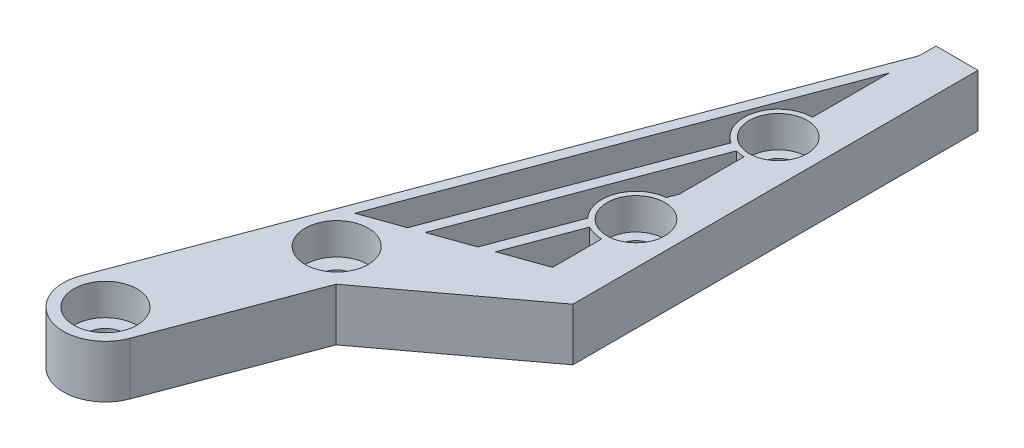
ISO-10303-21;
HEADER;
FILE_DESCRIPTION(('STEP AP214'),'2;1');
FILE_NAME('part.step','',(''),(''),'','','');
FILE_SCHEMA(('AUTOMOTIVE_DESIGN { 1 0 10303 214 1 1 1 1 }'));
ENDSEC;
DATA;
#1=APPLICATION_CONTEXT('core data for automotive mechanical design processes');
#2=APPLICATION_PROTOCOL_DEFINITION('international standard','automotive_design',2000,#1);
#3=PRODUCT_CONTEXT('',#1,'mechanical');
#4=PRODUCT('Part','Part','',(#3));
#5=PRODUCT_RELATED_PRODUCT_CATEGORY('part','',(#4));
#6=PRODUCT_DEFINITION_FORMATION('','',#4);
#7=PRODUCT_DEFINITION_CONTEXT('part definition',#1,'design');
#8=PRODUCT_DEFINITION('design','',#6,#7);
#9=PRODUCT_DEFINITION_SHAPE('','',#8);
#10=(LENGTH_UNIT() NAMED_UNIT(*) SI_UNIT(.MILLI.,.METRE.));
#11=(NAMED_UNIT(*) PLANE_ANGLE_UNIT() SI_UNIT($,.RADIAN.));
#12=(NAMED_UNIT(*) SI_UNIT($,.STERADIAN.) SOLID_ANGLE_UNIT());
#13=UNCERTAINTY_MEASURE_WITH_UNIT(LENGTH_MEASURE(1.E-05),#10,'distance_accuracy_value','');
#14=(GEOMETRIC_REPRESENTATION_CONTEXT(3) GLOBAL_UNCERTAINTY_ASSIGNED_CONTEXT((#13)) GLOBAL_UNIT_ASSIGNED_CONTEXT((#10,
#11,#12)) REPRESENTATION_CONTEXT('',''));
#15=CARTESIAN_POINT('',(0.,0.,0.));
#16=DIRECTION('',(0.,0.,1.));
#17=DIRECTION('',(1.,0.,0.));
#18=AXIS2_PLACEMENT_3D('',#15,#16,#17);
#19=CARTESIAN_POINT('',(0.,5.,0.));
#20=DIRECTION('',(0.,-1.,0.));
#21=DIRECTION('',(0.,0.,1.));
#22=AXIS2_PLACEMENT_3D('',#19,#20,#21);
#23=CYLINDRICAL_SURFACE('',#22,1.75);
#24=CARTESIAN_POINT('',(0.,0.,0.));
#25=DIRECTION('',(0.,-1.,0.));
#26=DIRECTION('',(0.,0.,-1.));
#27=AXIS2_PLACEMENT_3D('',#24,#25,#26);
#28=CIRCLE('',#27,1.75);
#29=CARTESIAN_POINT('',(0.,0.,-1.75));
#30=VERTEX_POINT('',#29);
#31=EDGE_CURVE('E335',#30,#30,#28,.T.);
#32=ORIENTED_EDGE('',*,*,#31,.T.);
#33=EDGE_LOOP('',(#32));
#34=FACE_BOUND('',#33,.T.);
#35=CARTESIAN_POINT('',(0.,2.,0.));
#36=DIRECTION('',(0.,-1.,0.));
#37=DIRECTION('',(0.,0.,-1.));
#38=AXIS2_PLACEMENT_3D('',#35,#36,#37);
#39=CIRCLE('',#38,1.75);
#40=CARTESIAN_POINT('',(0.,2.,-1.75));
#41=VERTEX_POINT('',#40);
#42=EDGE_CURVE('E43',#41,#41,#39,.T.);
#43=ORIENTED_EDGE('',*,*,#42,.F.);
#44=EDGE_LOOP('',(#43));
#45=FACE_BOUND('',#44,.T.);
#46=ADVANCED_FACE('F39',(#34,#45),#23,.F.);
#47=CARTESIAN_POINT('',(6.,5.,-16.));
#48=DIRECTION('',(0.,-1.,0.));
#49=DIRECTION('',(0.,0.,1.));
#50=AXIS2_PLACEMENT_3D('',#47,#48,#49);
#51=CYLINDRICAL_SURFACE('',#50,1.5);
#52=CARTESIAN_POINT('',(6.,0.,-16.));
#53=DIRECTION('',(0.,-1.,0.));
#54=DIRECTION('',(0.,0.,-1.));
#55=AXIS2_PLACEMENT_3D('',#52,#53,#54);
#56=CIRCLE('',#55,1.5);
#57=CARTESIAN_POINT('',(6.,0.,-17.5));
#58=VERTEX_POINT('',#57);
#59=EDGE_CURVE('E323',#58,#58,#56,.T.);
#60=ORIENTED_EDGE('',*,*,#59,.T.);
#61=EDGE_LOOP('',(#60));
#62=FACE_BOUND('',#61,.T.);
#63=CARTESIAN_POINT('',(6.,2.,-16.));
#64=DIRECTION('',(0.,-1.,0.));
#65=DIRECTION('',(0.,0.,-1.));
#66=AXIS2_PLACEMENT_3D('',#63,#64,#65);
#67=CIRCLE('',#66,1.5);
#68=CARTESIAN_POINT('',(6.,2.,-17.5));
#69=VERTEX_POINT('',#68);
#70=EDGE_CURVE('E397',#69,#69,#67,.T.);
#71=ORIENTED_EDGE('',*,*,#70,.F.);
#72=EDGE_LOOP('',(#71));
#73=FACE_BOUND('',#72,.T.);
#74=ADVANCED_FACE('F408',(#62,#73),#51,.F.);
#75=CARTESIAN_POINT('',(18.,-4.94974746830584,-46.));
#76=DIRECTION('',(0.,1.,0.));
#77=DIRECTION('',(0.,0.,-1.));
#78=AXIS2_PLACEMENT_3D('',#75,#76,#77);
#79=CYLINDRICAL_SURFACE('',#78,1.75);
#80=CARTESIAN_POINT('',(18.,0.,-46.));
#81=DIRECTION('',(0.,-1.,0.));
#82=DIRECTION('',(0.,0.,-1.));
#83=AXIS2_PLACEMENT_3D('',#80,#81,#82);
#84=CIRCLE('',#83,1.75);
#85=CARTESIAN_POINT('',(18.,0.,-47.75));
#86=VERTEX_POINT('',#85);
#87=EDGE_CURVE('E257',#86,#86,#84,.F.);
#88=ORIENTED_EDGE('',*,*,#87,.F.);
#89=EDGE_LOOP('',(#88));
#90=FACE_BOUND('',#89,.T.);
#91=CARTESIAN_POINT('',(18.,2.,-46.));
#92=DIRECTION('',(0.,-1.,0.));
#93=DIRECTION('',(0.,0.,-1.));
#94=AXIS2_PLACEMENT_3D('',#91,#92,#93);
#95=CIRCLE('',#94,1.75);
#96=CARTESIAN_POINT('',(18.,2.,-47.75));
#97=VERTEX_POINT('',#96);
#98=EDGE_CURVE('E395',#97,#97,#95,.F.);
#99=ORIENTED_EDGE('',*,*,#98,.T.);
#100=EDGE_LOOP('',(#99));
#101=FACE_BOUND('',#100,.T.);
#102=ADVANCED_FACE('F414',(#90,#101),#79,.F.);
#103=CARTESIAN_POINT('',(18.,-4.94974746830584,-32.4668375007661));
#104=DIRECTION('',(0.,1.,0.));
#105=DIRECTION('',(0.,0.,-1.));
#106=AXIS2_PLACEMENT_3D('',#103,#104,#105);
#107=CYLINDRICAL_SURFACE('',#106,1.75);
#108=CARTESIAN_POINT('',(18.,0.,-32.4668375007661));
#109=DIRECTION('',(0.,-1.,0.));
#110=DIRECTION('',(0.,0.,-1.));
#111=AXIS2_PLACEMENT_3D('',#108,#109,#110);
#112=CIRCLE('',#111,1.75);
#113=CARTESIAN_POINT('',(18.,0.,-34.2168375007661));
#114=VERTEX_POINT('',#113);
#115=EDGE_CURVE('E253',#114,#114,#112,.F.);
#116=ORIENTED_EDGE('',*,*,#115,.F.);
#117=EDGE_LOOP('',(#116));
#118=FACE_BOUND('',#117,.T.);
#119=CARTESIAN_POINT('',(18.,2.,-32.4668375007661));
#120=DIRECTION('',(0.,-1.,0.));
#121=DIRECTION('',(0.,0.,-1.));
#122=AXIS2_PLACEMENT_3D('',#119,#120,#121);
#123=CIRCLE('',#122,1.75);
#124=CARTESIAN_POINT('',(18.,2.,-34.2168375007661));
#125=VERTEX_POINT('',#124);
#126=EDGE_CURVE('E232',#125,#125,#123,.F.);
#127=ORIENTED_EDGE('',*,*,#126,.T.);
#128=EDGE_LOOP('',(#127));
#129=FACE_BOUND('',#128,.T.);
#130=ADVANCED_FACE('F792',(#118,#129),#107,.F.);
#131=CARTESIAN_POINT('',(12.7717220072743,-42.9863621817415,-22.6659203589747));
#132=DIRECTION('',(-0.936329177569045,0.,-0.351123441588392));
#133=DIRECTION('',(0.351123441588392,0.,-0.936329177569045));
#134=AXIS2_PLACEMENT_3D('',#131,#132,#133);
#135=PLANE('',#134);
#136=DIRECTION('',(0.,1.,0.));
#137=VECTOR('',#136,1.);
#138=CARTESIAN_POINT('',(17.6590925102293,-9.19238815542513,-35.6989083668547));
#139=LINE('',#138,#137);
#140=CARTESIAN_POINT('',(17.6590925102293,0.,-35.6989083668547));
#141=VERTEX_POINT('',#140);
#142=CARTESIAN_POINT('',(17.6590925102293,5.,-35.6989083668547));
#143=VERTEX_POINT('',#142);
#144=EDGE_CURVE('E48',#141,#143,#139,.T.);
#145=ORIENTED_EDGE('',*,*,#144,.T.);
#146=DIRECTION('',(0.351123441588392,0.,-0.936329177569045));
#147=VECTOR('',#146,1.);
#148=CARTESIAN_POINT('',(12.7717220072743,5.,-22.6659203589747));
#149=LINE('',#148,#147);
#150=CARTESIAN_POINT('',(18.,5.,-36.6079950062433));
#151=VERTEX_POINT('',#150);
#152=EDGE_CURVE('E285',#143,#151,#149,.T.);
#153=ORIENTED_EDGE('',*,*,#152,.T.);
#154=DIRECTION('',(0.,1.,0.));
#155=VECTOR('',#154,1.);
#156=CARTESIAN_POINT('',(18.,-42.9863621817415,-36.6079950062433));
#157=LINE('',#156,#155);
#158=CARTESIAN_POINT('',(18.,0.,-36.6079950062433));
#159=VERTEX_POINT('',#158);
#160=EDGE_CURVE('E298',#159,#151,#157,.T.);
#161=ORIENTED_EDGE('',*,*,#160,.F.);
#162=DIRECTION('',(-0.351123441588392,0.,0.936329177569045));
#163=VECTOR('',#162,1.);
#164=CARTESIAN_POINT('',(12.7717220072743,0.,-22.6659203589747));
#165=LINE('',#164,#163);
#166=EDGE_CURVE('E303',#159,#141,#165,.T.);
#167=ORIENTED_EDGE('',*,*,#166,.T.);
#168=EDGE_LOOP('',(#145,#153,#161,#167));
#169=FACE_BOUND('',#168,.T.);
#170=ADVANCED_FACE('F529',(#169),#135,.T.);
#171=CARTESIAN_POINT('',(18.,5.,-24.5331624992339));
#172=DIRECTION('',(1.,0.,0.));
#173=DIRECTION('',(0.,0.,1.));
#174=AXIS2_PLACEMENT_3D('',#171,#172,#173);
#175=PLANE('',#174);
#176=DIRECTION('',(0.,0.,-1.));
#177=VECTOR('',#176,1.);
#178=CARTESIAN_POINT('',(18.,0.,-24.5331624992339));
#179=LINE('',#178,#177);
#180=CARTESIAN_POINT('',(18.,0.,-24.5331624992339));
#181=VERTEX_POINT('',#180);
#182=CARTESIAN_POINT('',(18.,0.,-29.2168375007661));
#183=VERTEX_POINT('',#182);
#184=EDGE_CURVE('E369',#181,#183,#179,.T.);
#185=ORIENTED_EDGE('',*,*,#184,.F.);
#186=DIRECTION('',(0.,-1.,0.));
#187=VECTOR('',#186,1.);
#188=CARTESIAN_POINT('',(18.,5.,-24.5331624992339));
#189=LINE('',#188,#187);
#190=CARTESIAN_POINT('',(18.,5.,-24.5331624992339));
#191=VERTEX_POINT('',#190);
#192=EDGE_CURVE('E385',#191,#181,#189,.T.);
#193=ORIENTED_EDGE('',*,*,#192,.F.);
#194=DIRECTION('',(0.,0.,-1.));
#195=VECTOR('',#194,1.);
#196=CARTESIAN_POINT('',(18.,5.,-24.5331624992339));
#197=LINE('',#196,#195);
#198=CARTESIAN_POINT('',(18.,5.,-29.2168375007661));
#199=VERTEX_POINT('',#198);
#200=EDGE_CURVE('E349',#191,#199,#197,.T.);
#201=ORIENTED_EDGE('',*,*,#200,.T.);
#202=DIRECTION('',(0.,1.,0.));
#203=VECTOR('',#202,1.);
#204=CARTESIAN_POINT('',(18.,-9.19238815542513,-29.2168375007661));
#205=LINE('',#204,#203);
#206=EDGE_CURVE('E282',#183,#199,#205,.T.);
#207=ORIENTED_EDGE('',*,*,#206,.F.);
#208=EDGE_LOOP('',(#185,#193,#201,#207));
#209=FACE_BOUND('',#208,.T.);
#210=ADVANCED_FACE('F442',(#209),#175,.F.);
#211=CARTESIAN_POINT('',(2.90648056938186,5.,-19.1426198454417));
#212=DIRECTION('',(0.336336396998156,0.,0.941741911594837));
#213=DIRECTION('',(-0.941741911594837,0.,0.336336396998156));
#214=AXIS2_PLACEMENT_3D('',#211,#212,#213);
#215=PLANE('',#214);
#216=DIRECTION('',(0.941741911594837,0.,-0.336336396998156));
#217=VECTOR('',#216,1.);
#218=CARTESIAN_POINT('',(2.90648056938186,5.,-19.1426198454417));
#219=LINE('',#218,#217);
#220=CARTESIAN_POINT('',(14.0048771870108,5.,-23.1063329231663));
#221=VERTEX_POINT('',#220);
#222=EDGE_CURVE('E343',#221,#191,#219,.T.);
#223=ORIENTED_EDGE('',*,*,#222,.T.);
#224=ORIENTED_EDGE('',*,*,#192,.T.);
#225=DIRECTION('',(0.941741911594837,0.,-0.336336396998156));
#226=VECTOR('',#225,1.);
#227=CARTESIAN_POINT('',(2.90648056938186,0.,-19.1426198454417));
#228=LINE('',#227,#226);
#229=CARTESIAN_POINT('',(14.0048771870108,0.,-23.1063329231663));
#230=VERTEX_POINT('',#229);
#231=EDGE_CURVE('E363',#230,#181,#228,.T.);
#232=ORIENTED_EDGE('',*,*,#231,.F.);
#233=DIRECTION('',(0.,1.,0.));
#234=VECTOR('',#233,1.);
#235=CARTESIAN_POINT('',(14.0048771870108,-42.9863621817415,-23.1063329231663));
#236=LINE('',#235,#234);
#237=EDGE_CURVE('E290',#230,#221,#236,.T.);
#238=ORIENTED_EDGE('',*,*,#237,.T.);
#239=EDGE_LOOP('',(#223,#224,#232,#238));
#240=FACE_BOUND('',#239,.T.);
#241=ADVANCED_FACE('F446',(#240),#215,.F.);
#242=CARTESIAN_POINT('',(18.,0.,-42.75));
#243=VERTEX_POINT('',#242);
#244=EDGE_CURVE('E373',#159,#243,#179,.T.);
#245=ORIENTED_EDGE('',*,*,#244,.F.);
#246=ORIENTED_EDGE('',*,*,#160,.T.);
#247=CARTESIAN_POINT('',(18.,5.,-42.75));
#248=VERTEX_POINT('',#247);
#249=EDGE_CURVE('E353',#151,#248,#197,.T.);
#250=ORIENTED_EDGE('',*,*,#249,.T.);
#251=DIRECTION('',(0.,1.,0.));
#252=VECTOR('',#251,1.);
#253=CARTESIAN_POINT('',(18.,-9.19238815542513,-42.75));
#254=LINE('',#253,#252);
#255=EDGE_CURVE('E270',#243,#248,#254,.T.);
#256=ORIENTED_EDGE('',*,*,#255,.F.);
#257=EDGE_LOOP('',(#245,#246,#250,#256));
#258=FACE_BOUND('',#257,.T.);
#259=ADVANCED_FACE('F467',(#258),#175,.F.);
#260=CARTESIAN_POINT('',(9.07225646806461,0.,-21.3446826663998));
#261=VERTEX_POINT('',#260);
#262=CARTESIAN_POINT('',(12.7717220072743,0.,-22.6659203589747));
#263=VERTEX_POINT('',#262);
#264=EDGE_CURVE('E368',#261,#263,#228,.T.);
#265=ORIENTED_EDGE('',*,*,#264,.F.);
#266=DIRECTION('',(0.,1.,0.));
#267=VECTOR('',#266,1.);
#268=CARTESIAN_POINT('',(9.07225646806461,-42.9863621817415,-21.3446826663998));
#269=LINE('',#268,#267);
#270=CARTESIAN_POINT('',(9.07225646806461,5.,-21.3446826663998));
#271=VERTEX_POINT('',#270);
#272=EDGE_CURVE('E311',#261,#271,#269,.T.);
#273=ORIENTED_EDGE('',*,*,#272,.T.);
#274=CARTESIAN_POINT('',(12.7717220072743,5.,-22.6659203589747));
#275=VERTEX_POINT('',#274);
#276=EDGE_CURVE('E348',#271,#275,#219,.T.);
#277=ORIENTED_EDGE('',*,*,#276,.T.);
#278=DIRECTION('',(0.,1.,0.));
#279=VECTOR('',#278,1.);
#280=CARTESIAN_POINT('',(12.7717220072743,-42.9863621817415,-22.6659203589747));
#281=LINE('',#280,#279);
#282=EDGE_CURVE('E295',#263,#275,#281,.T.);
#283=ORIENTED_EDGE('',*,*,#282,.F.);
#284=EDGE_LOOP('',(#265,#273,#277,#283));
#285=FACE_BOUND('',#284,.T.);
#286=ADVANCED_FACE('F447',(#285),#215,.F.);
#287=CARTESIAN_POINT('',(18.,5.,-49.25));
#288=VERTEX_POINT('',#287);
#289=CARTESIAN_POINT('',(18.,5.,-56.5440037453176));
#290=VERTEX_POINT('',#289);
#291=EDGE_CURVE('E354',#288,#290,#197,.T.);
#292=ORIENTED_EDGE('',*,*,#291,.T.);
#293=DIRECTION('',(0.,1.,0.));
#294=VECTOR('',#293,1.);
#295=CARTESIAN_POINT('',(18.,-42.9863621817415,-56.5440037453176));
#296=LINE('',#295,#294);
#297=CARTESIAN_POINT('',(18.,0.,-56.5440037453176));
#298=VERTEX_POINT('',#297);
#299=EDGE_CURVE('E329',#298,#290,#296,.T.);
#300=ORIENTED_EDGE('',*,*,#299,.F.);
#301=CARTESIAN_POINT('',(18.,0.,-49.25));
#302=VERTEX_POINT('',#301);
#303=EDGE_CURVE('E374',#302,#298,#179,.T.);
#304=ORIENTED_EDGE('',*,*,#303,.F.);
#305=DIRECTION('',(0.,1.,0.));
#306=VECTOR('',#305,1.);
#307=CARTESIAN_POINT('',(18.,-9.19238815542513,-49.25));
#308=LINE('',#307,#306);
#309=EDGE_CURVE('E267',#288,#302,#308,.F.);
#310=ORIENTED_EDGE('',*,*,#309,.F.);
#311=EDGE_LOOP('',(#292,#300,#304,#310));
#312=FACE_BOUND('',#311,.T.);
#313=ADVANCED_FACE('F422',(#312),#175,.F.);
#314=CARTESIAN_POINT('',(0.,5.,0.));
#315=DIRECTION('',(0.,1.,0.));
#316=DIRECTION('',(0.,0.,-1.));
#317=AXIS2_PLACEMENT_3D('',#314,#315,#316);
#318=PLANE('',#317);
#319=DIRECTION('',(0.802095252658659,0.,-0.597196119932508));
#320=VECTOR('',#319,1.);
#321=CARTESIAN_POINT('',(9.09351943061815,5.,-12.8573801545583));
#322=LINE('',#321,#320);
#323=CARTESIAN_POINT('',(9.09351943061815,5.,-12.8573801545583));
#324=VERTEX_POINT('',#323);
#325=CARTESIAN_POINT('',(22.,5.,-22.4668375007661));
#326=VERTEX_POINT('',#325);
#327=EDGE_CURVE('E214',#324,#326,#322,.T.);
#328=ORIENTED_EDGE('',*,*,#327,.T.);
#329=DIRECTION('',(0.,0.,1.));
#330=VECTOR('',#329,1.);
#331=CARTESIAN_POINT('',(22.,5.,-17.4668375007661));
#332=LINE('',#331,#330);
#333=CARTESIAN_POINT('',(22.,5.,-61.));
#334=VERTEX_POINT('',#333);
#335=EDGE_CURVE('E218',#334,#326,#332,.T.);
#336=ORIENTED_EDGE('',*,*,#335,.F.);
#337=DIRECTION('',(1.,0.,0.));
#338=VECTOR('',#337,1.);
#339=CARTESIAN_POINT('',(18.,5.,-61.));
#340=LINE('',#339,#338);
#341=CARTESIAN_POINT('',(18.,5.,-61.));
#342=VERTEX_POINT('',#341);
#343=EDGE_CURVE('E352',#342,#334,#340,.T.);
#344=ORIENTED_EDGE('',*,*,#343,.F.);
#345=CARTESIAN_POINT('',(18.,5.,-59.3920049937567));
#346=VERTEX_POINT('',#345);
#347=EDGE_CURVE('E347',#346,#342,#197,.T.);
#348=ORIENTED_EDGE('',*,*,#347,.F.);
#349=DIRECTION('',(0.351123441588392,0.,-0.936329177569044));
#350=VECTOR('',#349,1.);
#351=CARTESIAN_POINT('',(-3.74531671027618,5.,-1.40449376635357));
#352=LINE('',#351,#350);
#353=CARTESIAN_POINT('',(-3.74531671027618,5.,-1.40449376635357));
#354=VERTEX_POINT('',#353);
#355=EDGE_CURVE('E340',#354,#346,#352,.T.);
#356=ORIENTED_EDGE('',*,*,#355,.F.);
#357=CARTESIAN_POINT('',(0.,5.,0.));
#358=DIRECTION('',(0.,-1.,0.));
#359=DIRECTION('',(0.,0.,-1.));
#360=AXIS2_PLACEMENT_3D('',#357,#358,#359);
#361=CIRCLE('',#360,4.);
#362=CARTESIAN_POINT('',(3.74531671027618,5.,1.40449376635357));
#363=VERTEX_POINT('',#362);
#364=EDGE_CURVE('E217',#363,#354,#361,.T.);
#365=ORIENTED_EDGE('',*,*,#364,.F.);
#366=DIRECTION('',(-0.351123441588392,0.,0.936329177569044));
#367=VECTOR('',#366,1.);
#368=CARTESIAN_POINT('',(3.74531671027618,5.,1.40449376635357));
#369=LINE('',#368,#367);
#370=EDGE_CURVE('E198',#324,#363,#369,.T.);
#371=ORIENTED_EDGE('',*,*,#370,.F.);
#372=EDGE_LOOP('',(#328,#336,#344,#348,#356,#365,#371));
#373=FACE_BOUND('',#372,.T.);
#374=CARTESIAN_POINT('',(0.,5.,0.));
#375=DIRECTION('',(0.,-1.,0.));
#376=DIRECTION('',(0.,0.,-1.));
#377=AXIS2_PLACEMENT_3D('',#374,#375,#376);
#378=CIRCLE('',#377,3.);
#379=CARTESIAN_POINT('',(0.,5.,-3.));
#380=VERTEX_POINT('',#379);
#381=EDGE_CURVE('E233',#380,#380,#378,.T.);
#382=ORIENTED_EDGE('',*,*,#381,.T.);
#383=EDGE_LOOP('',(#382));
#384=FACE_BOUND('',#383,.T.);
#385=CARTESIAN_POINT('',(6.,5.,-16.));
#386=DIRECTION('',(0.,-1.,0.));
#387=DIRECTION('',(0.,0.,-1.));
#388=AXIS2_PLACEMENT_3D('',#385,#386,#387);
#389=CIRCLE('',#388,3.);
#390=CARTESIAN_POINT('',(6.,5.,-19.));
#391=VERTEX_POINT('',#390);
#392=EDGE_CURVE('E239',#391,#391,#389,.T.);
#393=ORIENTED_EDGE('',*,*,#392,.T.);
#394=EDGE_LOOP('',(#393));
#395=FACE_BOUND('',#394,.T.);
#396=CARTESIAN_POINT('',(18.,5.,-32.4668375007661));
#397=DIRECTION('',(0.,-1.,0.));
#398=DIRECTION('',(0.,0.,-1.));
#399=AXIS2_PLACEMENT_3D('',#396,#397,#398);
#400=CIRCLE('',#399,2.75);
#401=CARTESIAN_POINT('',(18.,5.,-35.2168375007661));
#402=VERTEX_POINT('',#401);
#403=EDGE_CURVE('E245',#402,#402,#400,.T.);
#404=ORIENTED_EDGE('',*,*,#403,.T.);
#405=EDGE_LOOP('',(#404));
#406=FACE_BOUND('',#405,.T.);
#407=CARTESIAN_POINT('',(18.,5.,-46.));
#408=DIRECTION('',(0.,-1.,0.));
#409=DIRECTION('',(0.,0.,-1.));
#410=AXIS2_PLACEMENT_3D('',#407,#408,#409);
#411=CIRCLE('',#410,2.75);
#412=CARTESIAN_POINT('',(18.,5.,-48.75));
#413=VERTEX_POINT('',#412);
#414=EDGE_CURVE('E228',#413,#413,#411,.T.);
#415=ORIENTED_EDGE('',*,*,#414,.T.);
#416=EDGE_LOOP('',(#415));
#417=FACE_BOUND('',#416,.T.);
#418=CARTESIAN_POINT('',(18.,5.,-46.));
#419=DIRECTION('',(0.,-1.,0.));
#420=DIRECTION('',(0.,0.,-1.));
#421=AXIS2_PLACEMENT_3D('',#418,#419,#420);
#422=CIRCLE('',#421,3.25);
#423=CARTESIAN_POINT('',(16.2282724901686,5.,-43.2753933071163));
#424=VERTEX_POINT('',#423);
#425=EDGE_CURVE('E256',#424,#288,#422,.T.);
#426=ORIENTED_EDGE('',*,*,#425,.F.);
#427=DIRECTION('',(0.351123441588392,0.,-0.936329177569045));
#428=VECTOR('',#427,1.);
#429=CARTESIAN_POINT('',(7.83910128832806,5.,-20.9042701022082));
#430=LINE('',#429,#428);
#431=CARTESIAN_POINT('',(7.83910128832806,5.,-20.9042701022082));
#432=VERTEX_POINT('',#431);
#433=EDGE_CURVE('E306',#432,#424,#430,.T.);
#434=ORIENTED_EDGE('',*,*,#433,.F.);
#435=CARTESIAN_POINT('',(4.13963574911841,5.,-19.5830324096333));
#436=VERTEX_POINT('',#435);
#437=EDGE_CURVE('E344',#436,#432,#219,.T.);
#438=ORIENTED_EDGE('',*,*,#437,.F.);
#439=DIRECTION('',(-0.351123441588392,0.,0.936329177569045));
#440=VECTOR('',#439,1.);
#441=CARTESIAN_POINT('',(4.13963574911841,5.,-19.5830324096333));
#442=LINE('',#441,#440);
#443=EDGE_CURVE('E320',#290,#436,#442,.T.);
#444=ORIENTED_EDGE('',*,*,#443,.F.);
#445=ORIENTED_EDGE('',*,*,#291,.F.);
#446=EDGE_LOOP('',(#426,#434,#438,#444,#445));
#447=FACE_BOUND('',#446,.T.);
#448=ORIENTED_EDGE('',*,*,#249,.F.);
#449=ORIENTED_EDGE('',*,*,#152,.F.);
#450=CARTESIAN_POINT('',(18.,5.,-32.4668375007661));
#451=DIRECTION('',(0.,-1.,0.));
#452=DIRECTION('',(0.,0.,-1.));
#453=AXIS2_PLACEMENT_3D('',#450,#451,#452);
#454=CIRCLE('',#453,3.25);
#455=CARTESIAN_POINT('',(15.617954609457,5.,-30.2558739647953));
#456=VERTEX_POINT('',#455);
#457=EDGE_CURVE('E273',#456,#143,#454,.T.);
#458=ORIENTED_EDGE('',*,*,#457,.F.);
#459=EDGE_CURVE('E291',#275,#456,#149,.T.);
#460=ORIENTED_EDGE('',*,*,#459,.F.);
#461=ORIENTED_EDGE('',*,*,#276,.F.);
#462=DIRECTION('',(-0.351123441588392,0.,0.936329177569044));
#463=VECTOR('',#462,1.);
#464=CARTESIAN_POINT('',(18.,5.,-45.1519987515608));
#465=LINE('',#464,#463);
#466=CARTESIAN_POINT('',(17.1424429950306,5.,-42.8651800716424));
#467=VERTEX_POINT('',#466);
#468=EDGE_CURVE('E313',#467,#271,#465,.T.);
#469=ORIENTED_EDGE('',*,*,#468,.F.);
#470=EDGE_CURVE('E261',#248,#467,#422,.T.);
#471=ORIENTED_EDGE('',*,*,#470,.F.);
#472=EDGE_LOOP('',(#448,#449,#458,#460,#461,#469,#471));
#473=FACE_BOUND('',#472,.T.);
#474=CARTESIAN_POINT('',(16.4448934322859,5.,-29.6130429105665));
#475=VERTEX_POINT('',#474);
#476=EDGE_CURVE('E274',#199,#475,#454,.T.);
#477=ORIENTED_EDGE('',*,*,#476,.F.);
#478=ORIENTED_EDGE('',*,*,#200,.F.);
#479=ORIENTED_EDGE('',*,*,#222,.F.);
#480=DIRECTION('',(-0.351123441588392,0.,0.936329177569044));
#481=VECTOR('',#480,1.);
#482=CARTESIAN_POINT('',(18.,5.,-33.7599937578041));
#483=LINE('',#482,#481);
#484=EDGE_CURVE('E293',#475,#221,#483,.T.);
#485=ORIENTED_EDGE('',*,*,#484,.F.);
#486=EDGE_LOOP('',(#477,#478,#479,#485));
#487=FACE_BOUND('',#486,.T.);
#488=ADVANCED_FACE('F211',(#373,#384,#395,#406,#417,#447,#473,#487),#318,.T.);
#489=CARTESIAN_POINT('',(0.,0.,0.));
#490=DIRECTION('',(0.,1.,0.));
#491=DIRECTION('',(0.,0.,-1.));
#492=AXIS2_PLACEMENT_3D('',#489,#490,#491);
#493=PLANE('',#492);
#494=ORIENTED_EDGE('',*,*,#115,.T.);
#495=EDGE_LOOP('',(#494));
#496=FACE_BOUND('',#495,.T.);
#497=ORIENTED_EDGE('',*,*,#87,.T.);
#498=EDGE_LOOP('',(#497));
#499=FACE_BOUND('',#498,.T.);
#500=ORIENTED_EDGE('',*,*,#303,.T.);
#501=DIRECTION('',(0.351123441588392,0.,-0.936329177569045));
#502=VECTOR('',#501,1.);
#503=CARTESIAN_POINT('',(4.13963574911841,0.,-19.5830324096333));
#504=LINE('',#503,#502);
#505=CARTESIAN_POINT('',(4.13963574911841,0.,-19.5830324096333));
#506=VERTEX_POINT('',#505);
#507=EDGE_CURVE('E321',#506,#298,#504,.T.);
#508=ORIENTED_EDGE('',*,*,#507,.F.);
#509=CARTESIAN_POINT('',(7.83910128832806,0.,-20.9042701022082));
#510=VERTEX_POINT('',#509);
#511=EDGE_CURVE('E364',#506,#510,#228,.T.);
#512=ORIENTED_EDGE('',*,*,#511,.T.);
#513=DIRECTION('',(-0.351123441588392,0.,0.936329177569045));
#514=VECTOR('',#513,1.);
#515=CARTESIAN_POINT('',(7.83910128832806,0.,-20.9042701022082));
#516=LINE('',#515,#514);
#517=CARTESIAN_POINT('',(16.2282724901686,0.,-43.2753933071163));
#518=VERTEX_POINT('',#517);
#519=EDGE_CURVE('E310',#518,#510,#516,.T.);
#520=ORIENTED_EDGE('',*,*,#519,.F.);
#521=CARTESIAN_POINT('',(18.,0.,-46.));
#522=DIRECTION('',(0.,-1.,0.));
#523=DIRECTION('',(0.,0.,-1.));
#524=AXIS2_PLACEMENT_3D('',#521,#522,#523);
#525=CIRCLE('',#524,3.25);
#526=EDGE_CURVE('E262',#302,#518,#525,.F.);
#527=ORIENTED_EDGE('',*,*,#526,.F.);
#528=EDGE_LOOP('',(#500,#508,#512,#520,#527));
#529=FACE_BOUND('',#528,.T.);
#530=CARTESIAN_POINT('',(17.1424429950306,0.,-42.8651800716424));
#531=VERTEX_POINT('',#530);
#532=EDGE_CURVE('E265',#531,#243,#525,.F.);
#533=ORIENTED_EDGE('',*,*,#532,.F.);
#534=DIRECTION('',(0.351123441588392,0.,-0.936329177569045));
#535=VECTOR('',#534,1.);
#536=CARTESIAN_POINT('',(18.,0.,-45.1519987515608));
#537=LINE('',#536,#535);
#538=EDGE_CURVE('E307',#261,#531,#537,.T.);
#539=ORIENTED_EDGE('',*,*,#538,.F.);
#540=ORIENTED_EDGE('',*,*,#264,.T.);
#541=CARTESIAN_POINT('',(15.617954609457,0.,-30.2558739647953));
#542=VERTEX_POINT('',#541);
#543=EDGE_CURVE('E289',#542,#263,#165,.T.);
#544=ORIENTED_EDGE('',*,*,#543,.F.);
#545=CARTESIAN_POINT('',(18.,0.,-32.4668375007661));
#546=DIRECTION('',(0.,-1.,0.));
#547=DIRECTION('',(0.,0.,-1.));
#548=AXIS2_PLACEMENT_3D('',#545,#546,#547);
#549=CIRCLE('',#548,3.25);
#550=EDGE_CURVE('E278',#141,#542,#549,.F.);
#551=ORIENTED_EDGE('',*,*,#550,.F.);
#552=ORIENTED_EDGE('',*,*,#166,.F.);
#553=ORIENTED_EDGE('',*,*,#244,.T.);
#554=EDGE_LOOP('',(#533,#539,#540,#544,#551,#552,#553));
#555=FACE_BOUND('',#554,.T.);
#556=DIRECTION('',(0.351123441588392,0.,-0.936329177569044));
#557=VECTOR('',#556,1.);
#558=CARTESIAN_POINT('',(18.,0.,-33.7599937578041));
#559=LINE('',#558,#557);
#560=CARTESIAN_POINT('',(16.4448934322859,0.,-29.6130429105665));
#561=VERTEX_POINT('',#560);
#562=EDGE_CURVE('E286',#230,#561,#559,.T.);
#563=ORIENTED_EDGE('',*,*,#562,.F.);
#564=ORIENTED_EDGE('',*,*,#231,.T.);
#565=ORIENTED_EDGE('',*,*,#184,.T.);
#566=EDGE_CURVE('E277',#561,#183,#549,.F.);
#567=ORIENTED_EDGE('',*,*,#566,.F.);
#568=EDGE_LOOP('',(#563,#564,#565,#567));
#569=FACE_BOUND('',#568,.T.);
#570=DIRECTION('',(-0.351123441588392,0.,0.936329177569044));
#571=VECTOR('',#570,1.);
#572=CARTESIAN_POINT('',(3.74531671027618,0.,1.40449376635357));
#573=LINE('',#572,#571);
#574=CARTESIAN_POINT('',(9.09351943061815,0.,-12.8573801545583));
#575=VERTEX_POINT('',#574);
#576=CARTESIAN_POINT('',(3.74531671027618,0.,1.40449376635357));
#577=VERTEX_POINT('',#576);
#578=EDGE_CURVE('E201',#575,#577,#573,.T.);
#579=ORIENTED_EDGE('',*,*,#578,.T.);
#580=CARTESIAN_POINT('',(0.,0.,0.));
#581=DIRECTION('',(0.,-1.,0.));
#582=DIRECTION('',(0.,0.,-1.));
#583=AXIS2_PLACEMENT_3D('',#580,#581,#582);
#584=CIRCLE('',#583,4.);
#585=CARTESIAN_POINT('',(-3.74531671027618,0.,-1.40449376635357));
#586=VERTEX_POINT('',#585);
#587=EDGE_CURVE('E338',#577,#586,#584,.T.);
#588=ORIENTED_EDGE('',*,*,#587,.T.);
#589=DIRECTION('',(0.351123441588392,0.,-0.936329177569044));
#590=VECTOR('',#589,1.);
#591=CARTESIAN_POINT('',(-3.74531671027618,0.,-1.40449376635357));
#592=LINE('',#591,#590);
#593=CARTESIAN_POINT('',(18.,0.,-59.3920049937567));
#594=VERTEX_POINT('',#593);
#595=EDGE_CURVE('E360',#586,#594,#592,.T.);
#596=ORIENTED_EDGE('',*,*,#595,.T.);
#597=CARTESIAN_POINT('',(18.,0.,-61.));
#598=VERTEX_POINT('',#597);
#599=EDGE_CURVE('E367',#594,#598,#179,.T.);
#600=ORIENTED_EDGE('',*,*,#599,.T.);
#601=DIRECTION('',(1.,0.,0.));
#602=VECTOR('',#601,1.);
#603=CARTESIAN_POINT('',(18.,0.,-61.));
#604=LINE('',#603,#602);
#605=CARTESIAN_POINT('',(22.,0.,-61.));
#606=VERTEX_POINT('',#605);
#607=EDGE_CURVE('E372',#598,#606,#604,.T.);
#608=ORIENTED_EDGE('',*,*,#607,.T.);
#609=DIRECTION('',(0.,0.,1.));
#610=VECTOR('',#609,1.);
#611=CARTESIAN_POINT('',(22.,0.,-17.4668375007661));
#612=LINE('',#611,#610);
#613=CARTESIAN_POINT('',(22.,0.,-22.4668375007661));
#614=VERTEX_POINT('',#613);
#615=EDGE_CURVE('E377',#606,#614,#612,.T.);
#616=ORIENTED_EDGE('',*,*,#615,.T.);
#617=DIRECTION('',(-0.802095252658659,0.,0.597196119932508));
#618=VECTOR('',#617,1.);
#619=CARTESIAN_POINT('',(9.09351943061815,0.,-12.8573801545583));
#620=LINE('',#619,#618);
#621=EDGE_CURVE('E224',#614,#575,#620,.T.);
#622=ORIENTED_EDGE('',*,*,#621,.T.);
#623=EDGE_LOOP('',(#579,#588,#596,#600,#608,#616,#622));
#624=FACE_BOUND('',#623,.T.);
#625=ORIENTED_EDGE('',*,*,#31,.F.);
#626=EDGE_LOOP('',(#625));
#627=FACE_BOUND('',#626,.T.);
#628=ORIENTED_EDGE('',*,*,#59,.F.);
#629=EDGE_LOOP('',(#628));
#630=FACE_BOUND('',#629,.T.);
#631=ADVANCED_FACE('F421',(#496,#499,#529,#555,#569,#624,#627,#630),#493,.F.);
#632=CARTESIAN_POINT('',(0.,5.,0.));
#633=DIRECTION('',(0.,-1.,0.));
#634=DIRECTION('',(0.,0.,1.));
#635=AXIS2_PLACEMENT_3D('',#632,#633,#634);
#636=CYLINDRICAL_SURFACE('',#635,4.);
#637=ORIENTED_EDGE('',*,*,#587,.F.);
#638=DIRECTION('',(0.,-1.,0.));
#639=VECTOR('',#638,1.);
#640=CARTESIAN_POINT('',(3.74531671027618,5.,1.40449376635357));
#641=LINE('',#640,#639);
#642=EDGE_CURVE('E207',#363,#577,#641,.T.);
#643=ORIENTED_EDGE('',*,*,#642,.F.);
#644=ORIENTED_EDGE('',*,*,#364,.T.);
#645=DIRECTION('',(0.,-1.,0.));
#646=VECTOR('',#645,1.);
#647=CARTESIAN_POINT('',(-3.74531671027618,5.,-1.40449376635357));
#648=LINE('',#647,#646);
#649=EDGE_CURVE('E388',#354,#586,#648,.T.);
#650=ORIENTED_EDGE('',*,*,#649,.T.);
#651=EDGE_LOOP('',(#637,#643,#644,#650));
#652=FACE_BOUND('',#651,.T.);
#653=ADVANCED_FACE('F41',(#652),#636,.T.);
#654=CARTESIAN_POINT('',(-3.74531671027618,5.,-1.40449376635357));
#655=DIRECTION('',(0.936329177569044,0.,0.351123441588392));
#656=DIRECTION('',(-0.351123441588392,0.,0.936329177569045));
#657=AXIS2_PLACEMENT_3D('',#654,#655,#656);
#658=PLANE('',#657);
#659=ORIENTED_EDGE('',*,*,#595,.F.);
#660=ORIENTED_EDGE('',*,*,#649,.F.);
#661=ORIENTED_EDGE('',*,*,#355,.T.);
#662=DIRECTION('',(0.,1.,0.));
#663=VECTOR('',#662,1.);
#664=CARTESIAN_POINT('',(18.,-42.9863621817415,-59.3920049937567));
#665=LINE('',#664,#663);
#666=EDGE_CURVE('E327',#594,#346,#665,.T.);
#667=ORIENTED_EDGE('',*,*,#666,.F.);
#668=EDGE_LOOP('',(#659,#660,#661,#667));
#669=FACE_BOUND('',#668,.T.);
#670=ADVANCED_FACE('F444',(#669),#658,.F.);
#671=ORIENTED_EDGE('',*,*,#511,.F.);
#672=DIRECTION('',(0.,1.,0.));
#673=VECTOR('',#672,1.);
#674=CARTESIAN_POINT('',(4.13963574911841,-42.9863621817415,-19.5830324096333));
#675=LINE('',#674,#673);
#676=EDGE_CURVE('E324',#506,#436,#675,.T.);
#677=ORIENTED_EDGE('',*,*,#676,.T.);
#678=ORIENTED_EDGE('',*,*,#437,.T.);
#679=DIRECTION('',(0.,1.,0.));
#680=VECTOR('',#679,1.);
#681=CARTESIAN_POINT('',(7.83910128832806,-42.9863621817415,-20.9042701022082));
#682=LINE('',#681,#680);
#683=EDGE_CURVE('E315',#510,#432,#682,.T.);
#684=ORIENTED_EDGE('',*,*,#683,.F.);
#685=EDGE_LOOP('',(#671,#677,#678,#684));
#686=FACE_BOUND('',#685,.T.);
#687=ADVANCED_FACE('F440',(#686),#215,.F.);
#688=ORIENTED_EDGE('',*,*,#347,.T.);
#689=DIRECTION('',(0.,-1.,0.));
#690=VECTOR('',#689,1.);
#691=CARTESIAN_POINT('',(18.,5.,-61.));
#692=LINE('',#691,#690);
#693=EDGE_CURVE('E383',#342,#598,#692,.T.);
#694=ORIENTED_EDGE('',*,*,#693,.T.);
#695=ORIENTED_EDGE('',*,*,#599,.F.);
#696=ORIENTED_EDGE('',*,*,#666,.T.);
#697=EDGE_LOOP('',(#688,#694,#695,#696));
#698=FACE_BOUND('',#697,.T.);
#699=ADVANCED_FACE('F436',(#698),#175,.F.);
#700=CARTESIAN_POINT('',(18.,5.,-61.));
#701=DIRECTION('',(0.,0.,1.));
#702=DIRECTION('',(-1.,0.,0.));
#703=AXIS2_PLACEMENT_3D('',#700,#701,#702);
#704=PLANE('',#703);
#705=ORIENTED_EDGE('',*,*,#607,.F.);
#706=ORIENTED_EDGE('',*,*,#693,.F.);
#707=ORIENTED_EDGE('',*,*,#343,.T.);
#708=DIRECTION('',(0.,-1.,0.));
#709=VECTOR('',#708,1.);
#710=CARTESIAN_POINT('',(22.,5.,-61.));
#711=LINE('',#710,#709);
#712=EDGE_CURVE('E206',#334,#606,#711,.T.);
#713=ORIENTED_EDGE('',*,*,#712,.T.);
#714=EDGE_LOOP('',(#705,#706,#707,#713));
#715=FACE_BOUND('',#714,.T.);
#716=ADVANCED_FACE('F432',(#715),#704,.F.);
#717=CARTESIAN_POINT('',(22.,5.,-17.4668375007661));
#718=DIRECTION('',(-1.,0.,0.));
#719=DIRECTION('',(0.,0.,-1.));
#720=AXIS2_PLACEMENT_3D('',#717,#718,#719);
#721=PLANE('',#720);
#722=ORIENTED_EDGE('',*,*,#615,.F.);
#723=ORIENTED_EDGE('',*,*,#712,.F.);
#724=ORIENTED_EDGE('',*,*,#335,.T.);
#725=DIRECTION('',(0.,1.,0.));
#726=VECTOR('',#725,1.);
#727=CARTESIAN_POINT('',(22.,-16.0909574350446,-22.4668375007661));
#728=LINE('',#727,#726);
#729=EDGE_CURVE('E221',#614,#326,#728,.T.);
#730=ORIENTED_EDGE('',*,*,#729,.F.);
#731=EDGE_LOOP('',(#722,#723,#724,#730));
#732=FACE_BOUND('',#731,.T.);
#733=ADVANCED_FACE('F429',(#732),#721,.F.);
#734=CARTESIAN_POINT('',(3.74531671027618,5.,1.40449376635357));
#735=DIRECTION('',(-0.936329177569044,0.,-0.351123441588392));
#736=DIRECTION('',(0.351123441588392,0.,-0.936329177569044));
#737=AXIS2_PLACEMENT_3D('',#734,#735,#736);
#738=PLANE('',#737);
#739=ORIENTED_EDGE('',*,*,#578,.F.);
#740=DIRECTION('',(0.,-1.,0.));
#741=VECTOR('',#740,1.);
#742=CARTESIAN_POINT('',(9.09351943061815,5.,-12.8573801545583));
#743=LINE('',#742,#741);
#744=EDGE_CURVE('E195',#324,#575,#743,.T.);
#745=ORIENTED_EDGE('',*,*,#744,.F.);
#746=ORIENTED_EDGE('',*,*,#370,.T.);
#747=ORIENTED_EDGE('',*,*,#642,.T.);
#748=EDGE_LOOP('',(#739,#745,#746,#747));
#749=FACE_BOUND('',#748,.T.);
#750=ADVANCED_FACE('F197',(#749),#738,.F.);
#751=CARTESIAN_POINT('',(4.13963574911841,-42.9863621817415,-19.5830324096333));
#752=DIRECTION('',(0.936329177569045,0.,0.351123441588392));
#753=DIRECTION('',(-0.351123441588392,0.,0.936329177569045));
#754=AXIS2_PLACEMENT_3D('',#751,#752,#753);
#755=PLANE('',#754);
#756=ORIENTED_EDGE('',*,*,#507,.T.);
#757=ORIENTED_EDGE('',*,*,#299,.T.);
#758=ORIENTED_EDGE('',*,*,#443,.T.);
#759=ORIENTED_EDGE('',*,*,#676,.F.);
#760=EDGE_LOOP('',(#756,#757,#758,#759));
#761=FACE_BOUND('',#760,.T.);
#762=ADVANCED_FACE('F428',(#761),#755,.T.);
#763=CARTESIAN_POINT('',(18.,-42.9863621817415,-45.1519987515608));
#764=DIRECTION('',(0.936329177569045,0.,0.351123441588392));
#765=DIRECTION('',(-0.351123441588392,0.,0.936329177569045));
#766=AXIS2_PLACEMENT_3D('',#763,#764,#765);
#767=PLANE('',#766);
#768=DIRECTION('',(0.,1.,0.));
#769=VECTOR('',#768,1.);
#770=CARTESIAN_POINT('',(17.1424429950306,-9.19238815542513,-42.8651800716424));
#771=LINE('',#770,#769);
#772=EDGE_CURVE('E264',#531,#467,#771,.T.);
#773=ORIENTED_EDGE('',*,*,#772,.T.);
#774=ORIENTED_EDGE('',*,*,#468,.T.);
#775=ORIENTED_EDGE('',*,*,#272,.F.);
#776=ORIENTED_EDGE('',*,*,#538,.T.);
#777=EDGE_LOOP('',(#773,#774,#775,#776));
#778=FACE_BOUND('',#777,.T.);
#779=ADVANCED_FACE('F530',(#778),#767,.T.);
#780=CARTESIAN_POINT('',(7.83910128832806,-42.9863621817415,-20.9042701022082));
#781=DIRECTION('',(-0.936329177569045,0.,-0.351123441588392));
#782=DIRECTION('',(0.351123441588392,0.,-0.936329177569045));
#783=AXIS2_PLACEMENT_3D('',#780,#781,#782);
#784=PLANE('',#783);
#785=DIRECTION('',(0.,1.,0.));
#786=VECTOR('',#785,1.);
#787=CARTESIAN_POINT('',(16.2282724901686,-9.19238815542513,-43.2753933071163));
#788=LINE('',#787,#786);
#789=EDGE_CURVE('E11',#424,#518,#788,.F.);
#790=ORIENTED_EDGE('',*,*,#789,.T.);
#791=ORIENTED_EDGE('',*,*,#519,.T.);
#792=ORIENTED_EDGE('',*,*,#683,.T.);
#793=ORIENTED_EDGE('',*,*,#433,.T.);
#794=EDGE_LOOP('',(#790,#791,#792,#793));
#795=FACE_BOUND('',#794,.T.);
#796=ADVANCED_FACE('F500',(#795),#784,.T.);
#797=CARTESIAN_POINT('',(18.,-42.9863621817415,-33.7599937578041));
#798=DIRECTION('',(0.936329177569044,0.,0.351123441588392));
#799=DIRECTION('',(-0.351123441588392,0.,0.936329177569044));
#800=AXIS2_PLACEMENT_3D('',#797,#798,#799);
#801=PLANE('',#800);
#802=DIRECTION('',(0.,1.,0.));
#803=VECTOR('',#802,1.);
#804=CARTESIAN_POINT('',(16.4448934322859,-9.19238815542513,-29.6130429105665));
#805=LINE('',#804,#803);
#806=EDGE_CURVE('E280',#561,#475,#805,.T.);
#807=ORIENTED_EDGE('',*,*,#806,.T.);
#808=ORIENTED_EDGE('',*,*,#484,.T.);
#809=ORIENTED_EDGE('',*,*,#237,.F.);
#810=ORIENTED_EDGE('',*,*,#562,.T.);
#811=EDGE_LOOP('',(#807,#808,#809,#810));
#812=FACE_BOUND('',#811,.T.);
#813=ADVANCED_FACE('F523',(#812),#801,.T.);
#814=DIRECTION('',(0.,1.,0.));
#815=VECTOR('',#814,1.);
#816=CARTESIAN_POINT('',(15.617954609457,-9.19238815542513,-30.2558739647953));
#817=LINE('',#816,#815);
#818=EDGE_CURVE('E62',#456,#542,#817,.F.);
#819=ORIENTED_EDGE('',*,*,#818,.T.);
#820=ORIENTED_EDGE('',*,*,#543,.T.);
#821=ORIENTED_EDGE('',*,*,#282,.T.);
#822=ORIENTED_EDGE('',*,*,#459,.T.);
#823=EDGE_LOOP('',(#819,#820,#821,#822));
#824=FACE_BOUND('',#823,.T.);
#825=ADVANCED_FACE('F521',(#824),#135,.T.);
#826=CARTESIAN_POINT('',(18.,-9.19238815542513,-32.4668375007661));
#827=DIRECTION('',(0.,1.,0.));
#828=DIRECTION('',(0.,0.,-1.));
#829=AXIS2_PLACEMENT_3D('',#826,#827,#828);
#830=CYLINDRICAL_SURFACE('',#829,3.25);
#831=ORIENTED_EDGE('',*,*,#550,.T.);
#832=ORIENTED_EDGE('',*,*,#818,.F.);
#833=ORIENTED_EDGE('',*,*,#457,.T.);
#834=ORIENTED_EDGE('',*,*,#144,.F.);
#835=EDGE_LOOP('',(#831,#832,#833,#834));
#836=FACE_BOUND('',#835,.T.);
#837=ADVANCED_FACE('F514',(#836),#830,.T.);
#838=ORIENTED_EDGE('',*,*,#206,.T.);
#839=ORIENTED_EDGE('',*,*,#476,.T.);
#840=ORIENTED_EDGE('',*,*,#806,.F.);
#841=ORIENTED_EDGE('',*,*,#566,.T.);
#842=EDGE_LOOP('',(#838,#839,#840,#841));
#843=FACE_BOUND('',#842,.T.);
#844=ADVANCED_FACE('F507',(#843),#830,.T.);
#845=CARTESIAN_POINT('',(18.,-9.19238815542513,-46.));
#846=DIRECTION('',(0.,1.,0.));
#847=DIRECTION('',(0.,0.,-1.));
#848=AXIS2_PLACEMENT_3D('',#845,#846,#847);
#849=CYLINDRICAL_SURFACE('',#848,3.25);
#850=ORIENTED_EDGE('',*,*,#309,.T.);
#851=ORIENTED_EDGE('',*,*,#526,.T.);
#852=ORIENTED_EDGE('',*,*,#789,.F.);
#853=ORIENTED_EDGE('',*,*,#425,.T.);
#854=EDGE_LOOP('',(#850,#851,#852,#853));
#855=FACE_BOUND('',#854,.T.);
#856=ADVANCED_FACE('F505',(#855),#849,.T.);
#857=ORIENTED_EDGE('',*,*,#255,.T.);
#858=ORIENTED_EDGE('',*,*,#470,.T.);
#859=ORIENTED_EDGE('',*,*,#772,.F.);
#860=ORIENTED_EDGE('',*,*,#532,.T.);
#861=EDGE_LOOP('',(#857,#858,#859,#860));
#862=FACE_BOUND('',#861,.T.);
#863=ADVANCED_FACE('F479',(#862),#849,.T.);
#864=CARTESIAN_POINT('',(18.,2.,-32.4668375007661));
#865=DIRECTION('',(0.,1.,0.));
#866=DIRECTION('',(0.,0.,-1.));
#867=AXIS2_PLACEMENT_3D('',#864,#865,#866);
#868=PLANE('',#867);
#869=CARTESIAN_POINT('',(18.,2.,-32.4668375007661));
#870=DIRECTION('',(0.,-1.,0.));
#871=DIRECTION('',(0.,0.,-1.));
#872=AXIS2_PLACEMENT_3D('',#869,#870,#871);
#873=CIRCLE('',#872,2.75);
#874=CARTESIAN_POINT('',(18.,2.,-35.2168375007661));
#875=VERTEX_POINT('',#874);
#876=EDGE_CURVE('E242',#875,#875,#873,.T.);
#877=ORIENTED_EDGE('',*,*,#876,.F.);
#878=EDGE_LOOP('',(#877));
#879=FACE_BOUND('',#878,.T.);
#880=ORIENTED_EDGE('',*,*,#126,.F.);
#881=EDGE_LOOP('',(#880));
#882=FACE_BOUND('',#881,.T.);
#883=ADVANCED_FACE('F513',(#879,#882),#868,.T.);
#884=CARTESIAN_POINT('',(18.,2.,-32.4668375007661));
#885=DIRECTION('',(0.,1.,0.));
#886=DIRECTION('',(0.,0.,-1.));
#887=AXIS2_PLACEMENT_3D('',#884,#885,#886);
#888=CYLINDRICAL_SURFACE('',#887,2.75);
#889=ORIENTED_EDGE('',*,*,#876,.T.);
#890=EDGE_LOOP('',(#889));
#891=FACE_BOUND('',#890,.T.);
#892=ORIENTED_EDGE('',*,*,#403,.F.);
#893=EDGE_LOOP('',(#892));
#894=FACE_BOUND('',#893,.T.);
#895=ADVANCED_FACE('F593',(#891,#894),#888,.F.);
#896=CARTESIAN_POINT('',(18.,2.,-46.));
#897=DIRECTION('',(0.,1.,0.));
#898=DIRECTION('',(0.,0.,-1.));
#899=AXIS2_PLACEMENT_3D('',#896,#897,#898);
#900=PLANE('',#899);
#901=CARTESIAN_POINT('',(18.,2.,-46.));
#902=DIRECTION('',(0.,-1.,0.));
#903=DIRECTION('',(0.,0.,-1.));
#904=AXIS2_PLACEMENT_3D('',#901,#902,#903);
#905=CIRCLE('',#904,2.75);
#906=CARTESIAN_POINT('',(18.,2.,-48.75));
#907=VERTEX_POINT('',#906);
#908=EDGE_CURVE('E248',#907,#907,#905,.T.);
#909=ORIENTED_EDGE('',*,*,#908,.F.);
#910=EDGE_LOOP('',(#909));
#911=FACE_BOUND('',#910,.T.);
#912=ORIENTED_EDGE('',*,*,#98,.F.);
#913=EDGE_LOOP('',(#912));
#914=FACE_BOUND('',#913,.T.);
#915=ADVANCED_FACE('F604',(#911,#914),#900,.T.);
#916=CARTESIAN_POINT('',(18.,2.,-46.));
#917=DIRECTION('',(0.,1.,0.));
#918=DIRECTION('',(0.,0.,-1.));
#919=AXIS2_PLACEMENT_3D('',#916,#917,#918);
#920=CYLINDRICAL_SURFACE('',#919,2.75);
#921=ORIENTED_EDGE('',*,*,#908,.T.);
#922=EDGE_LOOP('',(#921));
#923=FACE_BOUND('',#922,.T.);
#924=ORIENTED_EDGE('',*,*,#414,.F.);
#925=EDGE_LOOP('',(#924));
#926=FACE_BOUND('',#925,.T.);
#927=ADVANCED_FACE('F615',(#923,#926),#920,.F.);
#928=CARTESIAN_POINT('',(6.,2.,-16.));
#929=DIRECTION('',(0.,1.,0.));
#930=DIRECTION('',(0.,0.,-1.));
#931=AXIS2_PLACEMENT_3D('',#928,#929,#930);
#932=CYLINDRICAL_SURFACE('',#931,3.);
#933=CARTESIAN_POINT('',(6.,2.,-16.));
#934=DIRECTION('',(0.,-1.,0.));
#935=DIRECTION('',(0.,0.,-1.));
#936=AXIS2_PLACEMENT_3D('',#933,#934,#935);
#937=CIRCLE('',#936,3.);
#938=CARTESIAN_POINT('',(6.,2.,-19.));
#939=VERTEX_POINT('',#938);
#940=EDGE_CURVE('E236',#939,#939,#937,.T.);
#941=ORIENTED_EDGE('',*,*,#940,.T.);
#942=EDGE_LOOP('',(#941));
#943=FACE_BOUND('',#942,.T.);
#944=ORIENTED_EDGE('',*,*,#392,.F.);
#945=EDGE_LOOP('',(#944));
#946=FACE_BOUND('',#945,.T.);
#947=ADVANCED_FACE('F626',(#943,#946),#932,.F.);
#948=CARTESIAN_POINT('',(6.,2.,-16.));
#949=DIRECTION('',(0.,1.,0.));
#950=DIRECTION('',(0.,0.,-1.));
#951=AXIS2_PLACEMENT_3D('',#948,#949,#950);
#952=PLANE('',#951);
#953=ORIENTED_EDGE('',*,*,#70,.T.);
#954=EDGE_LOOP('',(#953));
#955=FACE_BOUND('',#954,.T.);
#956=ORIENTED_EDGE('',*,*,#940,.F.);
#957=EDGE_LOOP('',(#956));
#958=FACE_BOUND('',#957,.T.);
#959=ADVANCED_FACE('F637',(#955,#958),#952,.T.);
#960=CARTESIAN_POINT('',(0.,2.,0.));
#961=DIRECTION('',(0.,1.,0.));
#962=DIRECTION('',(0.,0.,-1.));
#963=AXIS2_PLACEMENT_3D('',#960,#961,#962);
#964=CYLINDRICAL_SURFACE('',#963,3.);
#965=CARTESIAN_POINT('',(0.,2.,0.));
#966=DIRECTION('',(0.,-1.,0.));
#967=DIRECTION('',(0.,0.,-1.));
#968=AXIS2_PLACEMENT_3D('',#965,#966,#967);
#969=CIRCLE('',#968,3.);
#970=CARTESIAN_POINT('',(0.,2.,-3.));
#971=VERTEX_POINT('',#970);
#972=EDGE_CURVE('E229',#971,#971,#969,.T.);
#973=ORIENTED_EDGE('',*,*,#972,.T.);
#974=EDGE_LOOP('',(#973));
#975=FACE_BOUND('',#974,.T.);
#976=ORIENTED_EDGE('',*,*,#381,.F.);
#977=EDGE_LOOP('',(#976));
#978=FACE_BOUND('',#977,.T.);
#979=ADVANCED_FACE('F648',(#975,#978),#964,.F.);
#980=CARTESIAN_POINT('',(0.,2.,0.));
#981=DIRECTION('',(0.,1.,0.));
#982=DIRECTION('',(0.,0.,-1.));
#983=AXIS2_PLACEMENT_3D('',#980,#981,#982);
#984=PLANE('',#983);
#985=ORIENTED_EDGE('',*,*,#42,.T.);
#986=EDGE_LOOP('',(#985));
#987=FACE_BOUND('',#986,.T.);
#988=ORIENTED_EDGE('',*,*,#972,.F.);
#989=EDGE_LOOP('',(#988));
#990=FACE_BOUND('',#989,.T.);
#991=ADVANCED_FACE('F404',(#987,#990),#984,.T.);
#992=CARTESIAN_POINT('',(9.09351943061815,-16.0909574350446,-12.8573801545583));
#993=DIRECTION('',(-0.597196119932508,0.,-0.802095252658659));
#994=DIRECTION('',(0.802095252658659,0.,-0.597196119932508));
#995=AXIS2_PLACEMENT_3D('',#992,#993,#994);
#996=PLANE('',#995);
#997=ORIENTED_EDGE('',*,*,#621,.F.);
#998=ORIENTED_EDGE('',*,*,#729,.T.);
#999=ORIENTED_EDGE('',*,*,#327,.F.);
#1000=ORIENTED_EDGE('',*,*,#744,.T.);
#1001=EDGE_LOOP('',(#997,#998,#999,#1000));
#1002=FACE_BOUND('',#1001,.T.);
#1003=ADVANCED_FACE('F220',(#1002),#996,.F.);
#1004=CLOSED_SHELL('',(#46,#74,#102,#130,#170,#210,#241,#259,#286,#313,#488,#631,#653,#670,#687,
#699,#716,#733,#750,#762,#779,#796,#813,#825,#837,#844,#856,#863,#883,#895,#915,#927,#947,#959,
#979,#991,#1003));
#1005=MANIFOLD_SOLID_BREP('B2',#1004);
#1006=ADVANCED_BREP_SHAPE_REPRESENTATION('',(#18,#1005),#14);
#1007=SHAPE_DEFINITION_REPRESENTATION(#9,#1006);
ENDSEC;
END-ISO-10303-21;
